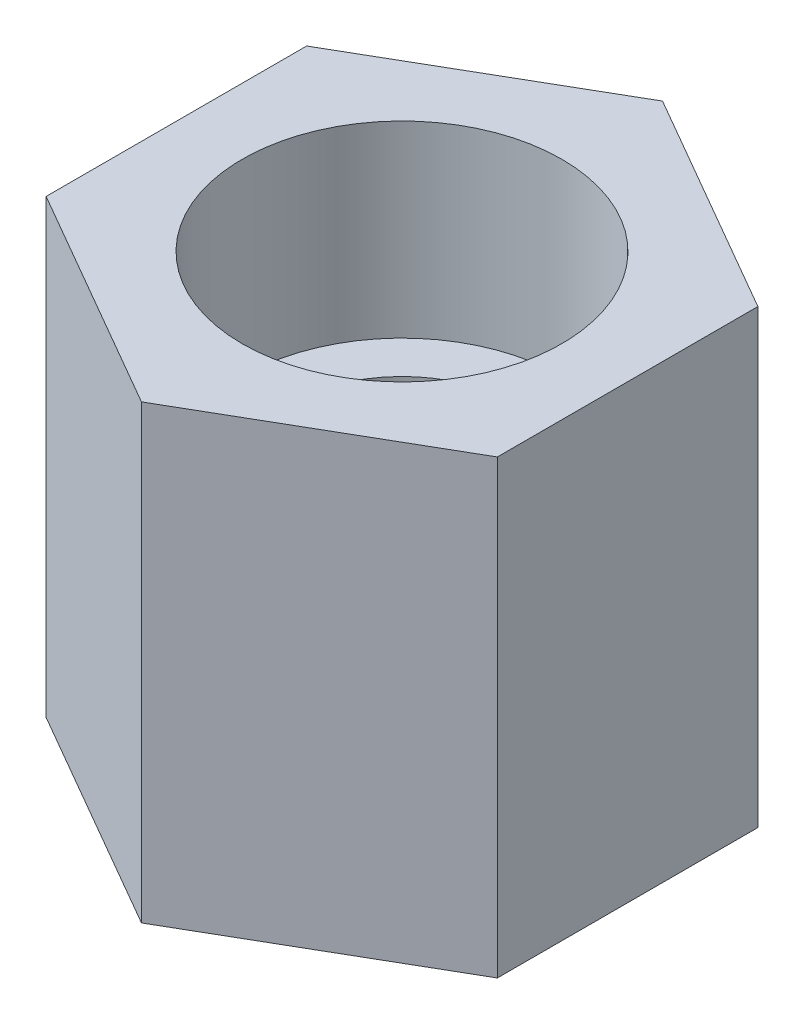
ISO-10303-21;
HEADER;
FILE_DESCRIPTION(('STEP AP214'),'2;1');
FILE_NAME('part.step','',(''),(''),'','','');
FILE_SCHEMA(('AUTOMOTIVE_DESIGN { 1 0 10303 214 1 1 1 1 }'));
ENDSEC;
DATA;
#1=APPLICATION_CONTEXT('core data for automotive mechanical design processes');
#2=APPLICATION_PROTOCOL_DEFINITION('international standard','automotive_design',2000,#1);
#3=PRODUCT_CONTEXT('',#1,'mechanical');
#4=PRODUCT('Part','Part','',(#3));
#5=PRODUCT_RELATED_PRODUCT_CATEGORY('part','',(#4));
#6=PRODUCT_DEFINITION_FORMATION('','',#4);
#7=PRODUCT_DEFINITION_CONTEXT('part definition',#1,'design');
#8=PRODUCT_DEFINITION('design','',#6,#7);
#9=PRODUCT_DEFINITION_SHAPE('','',#8);
#10=(LENGTH_UNIT() NAMED_UNIT(*) SI_UNIT(.MILLI.,.METRE.));
#11=(NAMED_UNIT(*) PLANE_ANGLE_UNIT() SI_UNIT($,.RADIAN.));
#12=(NAMED_UNIT(*) SI_UNIT($,.STERADIAN.) SOLID_ANGLE_UNIT());
#13=UNCERTAINTY_MEASURE_WITH_UNIT(LENGTH_MEASURE(1.E-05),#10,'distance_accuracy_value','');
#14=(GEOMETRIC_REPRESENTATION_CONTEXT(3) GLOBAL_UNCERTAINTY_ASSIGNED_CONTEXT((#13)) GLOBAL_UNIT_ASSIGNED_CONTEXT((#10,
#11,#12)) REPRESENTATION_CONTEXT('',''));
#15=CARTESIAN_POINT('',(0.,0.,0.));
#16=DIRECTION('',(0.,0.,1.));
#17=DIRECTION('',(1.,0.,0.));
#18=AXIS2_PLACEMENT_3D('',#15,#16,#17);
#19=CARTESIAN_POINT('',(0.,24.,0.));
#20=DIRECTION('',(0.,-1.,0.));
#21=DIRECTION('',(0.,0.,-1.));
#22=AXIS2_PLACEMENT_3D('',#19,#20,#21);
#23=CYLINDRICAL_SURFACE('',#22,6.);
#24=CARTESIAN_POINT('',(0.,0.,0.));
#25=DIRECTION('',(0.,1.,0.));
#26=DIRECTION('',(0.,0.,1.));
#27=AXIS2_PLACEMENT_3D('',#24,#25,#26);
#28=CIRCLE('',#27,6.);
#29=CARTESIAN_POINT('',(0.,0.,6.));
#30=VERTEX_POINT('',#29);
#31=EDGE_CURVE('E124',#30,#30,#28,.T.);
#32=ORIENTED_EDGE('',*,*,#31,.F.);
#33=EDGE_LOOP('',(#32));
#34=FACE_BOUND('',#33,.T.);
#35=CARTESIAN_POINT('',(0.,14.,0.));
#36=DIRECTION('',(0.,1.,0.));
#37=DIRECTION('',(0.,0.,1.));
#38=AXIS2_PLACEMENT_3D('',#35,#36,#37);
#39=CIRCLE('',#38,6.);
#40=CARTESIAN_POINT('',(0.,14.,6.));
#41=VERTEX_POINT('',#40);
#42=EDGE_CURVE('E38',#41,#41,#39,.T.);
#43=ORIENTED_EDGE('',*,*,#42,.T.);
#44=EDGE_LOOP('',(#43));
#45=FACE_BOUND('',#44,.T.);
#46=ADVANCED_FACE('F34',(#34,#45),#23,.F.);
#47=CARTESIAN_POINT('',(0.,24.,0.));
#48=DIRECTION('',(0.,1.,0.));
#49=DIRECTION('',(0.,0.,1.));
#50=AXIS2_PLACEMENT_3D('',#47,#48,#49);
#51=PLANE('',#50);
#52=CARTESIAN_POINT('',(0.,24.,0.));
#53=DIRECTION('',(0.,1.,0.));
#54=DIRECTION('',(0.,0.,1.));
#55=AXIS2_PLACEMENT_3D('',#52,#53,#54);
#56=CIRCLE('',#55,8.5);
#57=CARTESIAN_POINT('',(0.,24.,8.5));
#58=VERTEX_POINT('',#57);
#59=EDGE_CURVE('E231',#58,#58,#56,.T.);
#60=ORIENTED_EDGE('',*,*,#59,.F.);
#61=EDGE_LOOP('',(#60));
#62=FACE_BOUND('',#61,.T.);
#63=DIRECTION('',(-0.866025403784439,0.,-0.5));
#64=VECTOR('',#63,1.);
#65=CARTESIAN_POINT('',(12.,24.,-6.92820323027552));
#66=LINE('',#65,#64);
#67=CARTESIAN_POINT('',(12.,24.,-6.92820323027552));
#68=VERTEX_POINT('',#67);
#69=CARTESIAN_POINT('',(0.,24.,-13.856406460551));
#70=VERTEX_POINT('',#69);
#71=EDGE_CURVE('E131',#68,#70,#66,.T.);
#72=ORIENTED_EDGE('',*,*,#71,.T.);
#73=DIRECTION('',(-0.866025403784439,0.,0.5));
#74=VECTOR('',#73,1.);
#75=CARTESIAN_POINT('',(0.,24.,-13.856406460551));
#76=LINE('',#75,#74);
#77=CARTESIAN_POINT('',(-12.,24.,-6.92820323027551));
#78=VERTEX_POINT('',#77);
#79=EDGE_CURVE('E89',#70,#78,#76,.T.);
#80=ORIENTED_EDGE('',*,*,#79,.T.);
#81=DIRECTION('',(0.,0.,1.));
#82=VECTOR('',#81,1.);
#83=CARTESIAN_POINT('',(-12.,24.,-6.92820323027551));
#84=LINE('',#83,#82);
#85=CARTESIAN_POINT('',(-12.,24.,6.92820323027551));
#86=VERTEX_POINT('',#85);
#87=EDGE_CURVE('E102',#78,#86,#84,.T.);
#88=ORIENTED_EDGE('',*,*,#87,.T.);
#89=DIRECTION('',(0.866025403784439,0.,0.5));
#90=VECTOR('',#89,1.);
#91=CARTESIAN_POINT('',(-12.,24.,6.92820323027551));
#92=LINE('',#91,#90);
#93=CARTESIAN_POINT('',(0.,24.,13.856406460551));
#94=VERTEX_POINT('',#93);
#95=EDGE_CURVE('E96',#86,#94,#92,.T.);
#96=ORIENTED_EDGE('',*,*,#95,.T.);
#97=DIRECTION('',(0.866025403784439,0.,-0.5));
#98=VECTOR('',#97,1.);
#99=CARTESIAN_POINT('',(0.,24.,13.856406460551));
#100=LINE('',#99,#98);
#101=CARTESIAN_POINT('',(12.,24.,6.92820323027551));
#102=VERTEX_POINT('',#101);
#103=EDGE_CURVE('E100',#94,#102,#100,.T.);
#104=ORIENTED_EDGE('',*,*,#103,.T.);
#105=DIRECTION('',(0.,0.,-1.));
#106=VECTOR('',#105,1.);
#107=CARTESIAN_POINT('',(12.,24.,6.92820323027551));
#108=LINE('',#107,#106);
#109=EDGE_CURVE('E52',#102,#68,#108,.T.);
#110=ORIENTED_EDGE('',*,*,#109,.T.);
#111=EDGE_LOOP('',(#72,#80,#88,#96,#104,#110));
#112=FACE_BOUND('',#111,.T.);
#113=ADVANCED_FACE('F98',(#62,#112),#51,.T.);
#114=CARTESIAN_POINT('',(0.,0.,0.));
#115=DIRECTION('',(0.,1.,0.));
#116=DIRECTION('',(0.,0.,1.));
#117=AXIS2_PLACEMENT_3D('',#114,#115,#116);
#118=PLANE('',#117);
#119=DIRECTION('',(-0.866025403784439,0.,-0.5));
#120=VECTOR('',#119,1.);
#121=CARTESIAN_POINT('',(12.,0.,-6.92820323027552));
#122=LINE('',#121,#120);
#123=CARTESIAN_POINT('',(12.,0.,-6.92820323027552));
#124=VERTEX_POINT('',#123);
#125=CARTESIAN_POINT('',(0.,0.,-13.856406460551));
#126=VERTEX_POINT('',#125);
#127=EDGE_CURVE('E120',#124,#126,#122,.T.);
#128=ORIENTED_EDGE('',*,*,#127,.F.);
#129=DIRECTION('',(0.,0.,-1.));
#130=VECTOR('',#129,1.);
#131=CARTESIAN_POINT('',(12.,0.,6.92820323027551));
#132=LINE('',#131,#130);
#133=CARTESIAN_POINT('',(12.,0.,6.92820323027551));
#134=VERTEX_POINT('',#133);
#135=EDGE_CURVE('E81',#134,#124,#132,.T.);
#136=ORIENTED_EDGE('',*,*,#135,.F.);
#137=DIRECTION('',(0.866025403784439,0.,-0.5));
#138=VECTOR('',#137,1.);
#139=CARTESIAN_POINT('',(0.,0.,13.856406460551));
#140=LINE('',#139,#138);
#141=CARTESIAN_POINT('',(0.,0.,13.856406460551));
#142=VERTEX_POINT('',#141);
#143=EDGE_CURVE('E75',#142,#134,#140,.T.);
#144=ORIENTED_EDGE('',*,*,#143,.F.);
#145=DIRECTION('',(0.866025403784439,0.,0.5));
#146=VECTOR('',#145,1.);
#147=CARTESIAN_POINT('',(-12.,0.,6.92820323027551));
#148=LINE('',#147,#146);
#149=CARTESIAN_POINT('',(-12.,0.,6.92820323027551));
#150=VERTEX_POINT('',#149);
#151=EDGE_CURVE('E110',#150,#142,#148,.T.);
#152=ORIENTED_EDGE('',*,*,#151,.F.);
#153=DIRECTION('',(0.,0.,1.));
#154=VECTOR('',#153,1.);
#155=CARTESIAN_POINT('',(-12.,0.,-6.92820323027551));
#156=LINE('',#155,#154);
#157=CARTESIAN_POINT('',(-12.,0.,-6.92820323027551));
#158=VERTEX_POINT('',#157);
#159=EDGE_CURVE('E126',#158,#150,#156,.T.);
#160=ORIENTED_EDGE('',*,*,#159,.F.);
#161=DIRECTION('',(-0.866025403784439,0.,0.5));
#162=VECTOR('',#161,1.);
#163=CARTESIAN_POINT('',(0.,0.,-13.856406460551));
#164=LINE('',#163,#162);
#165=EDGE_CURVE('E123',#126,#158,#164,.T.);
#166=ORIENTED_EDGE('',*,*,#165,.F.);
#167=EDGE_LOOP('',(#128,#136,#144,#152,#160,#166));
#168=FACE_BOUND('',#167,.T.);
#169=ORIENTED_EDGE('',*,*,#31,.T.);
#170=EDGE_LOOP('',(#169));
#171=FACE_BOUND('',#170,.T.);
#172=ADVANCED_FACE('F141',(#168,#171),#118,.F.);
#173=CARTESIAN_POINT('',(12.,24.,-6.92820323027552));
#174=DIRECTION('',(-0.5,0.,0.866025403784439));
#175=DIRECTION('',(0.866025403784439,0.,0.5));
#176=AXIS2_PLACEMENT_3D('',#173,#174,#175);
#177=PLANE('',#176);
#178=ORIENTED_EDGE('',*,*,#127,.T.);
#179=DIRECTION('',(0.,-1.,0.));
#180=VECTOR('',#179,1.);
#181=CARTESIAN_POINT('',(0.,24.,-13.856406460551));
#182=LINE('',#181,#180);
#183=EDGE_CURVE('E11',#70,#126,#182,.T.);
#184=ORIENTED_EDGE('',*,*,#183,.F.);
#185=ORIENTED_EDGE('',*,*,#71,.F.);
#186=DIRECTION('',(0.,-1.,0.));
#187=VECTOR('',#186,1.);
#188=CARTESIAN_POINT('',(12.,24.,-6.92820323027552));
#189=LINE('',#188,#187);
#190=EDGE_CURVE('E116',#68,#124,#189,.T.);
#191=ORIENTED_EDGE('',*,*,#190,.T.);
#192=EDGE_LOOP('',(#178,#184,#185,#191));
#193=FACE_BOUND('',#192,.T.);
#194=ADVANCED_FACE('F36',(#193),#177,.F.);
#195=CARTESIAN_POINT('',(0.,24.,-13.856406460551));
#196=DIRECTION('',(0.5,0.,0.866025403784438));
#197=DIRECTION('',(0.866025403784439,0.,-0.5));
#198=AXIS2_PLACEMENT_3D('',#195,#196,#197);
#199=PLANE('',#198);
#200=ORIENTED_EDGE('',*,*,#165,.T.);
#201=DIRECTION('',(0.,-1.,0.));
#202=VECTOR('',#201,1.);
#203=CARTESIAN_POINT('',(-12.,24.,-6.92820323027551));
#204=LINE('',#203,#202);
#205=EDGE_CURVE('E44',#78,#158,#204,.T.);
#206=ORIENTED_EDGE('',*,*,#205,.F.);
#207=ORIENTED_EDGE('',*,*,#79,.F.);
#208=ORIENTED_EDGE('',*,*,#183,.T.);
#209=EDGE_LOOP('',(#200,#206,#207,#208));
#210=FACE_BOUND('',#209,.T.);
#211=ADVANCED_FACE('F174',(#210),#199,.F.);
#212=CARTESIAN_POINT('',(-12.,24.,-6.92820323027551));
#213=DIRECTION('',(1.,0.,0.));
#214=DIRECTION('',(0.,0.,-1.));
#215=AXIS2_PLACEMENT_3D('',#212,#213,#214);
#216=PLANE('',#215);
#217=ORIENTED_EDGE('',*,*,#159,.T.);
#218=DIRECTION('',(0.,-1.,0.));
#219=VECTOR('',#218,1.);
#220=CARTESIAN_POINT('',(-12.,24.,6.92820323027551));
#221=LINE('',#220,#219);
#222=EDGE_CURVE('E111',#86,#150,#221,.T.);
#223=ORIENTED_EDGE('',*,*,#222,.F.);
#224=ORIENTED_EDGE('',*,*,#87,.F.);
#225=ORIENTED_EDGE('',*,*,#205,.T.);
#226=EDGE_LOOP('',(#217,#223,#224,#225));
#227=FACE_BOUND('',#226,.T.);
#228=ADVANCED_FACE('F138',(#227),#216,.F.);
#229=CARTESIAN_POINT('',(-12.,24.,6.92820323027551));
#230=DIRECTION('',(0.5,0.,-0.866025403784439));
#231=DIRECTION('',(-0.866025403784439,0.,-0.5));
#232=AXIS2_PLACEMENT_3D('',#229,#230,#231);
#233=PLANE('',#232);
#234=ORIENTED_EDGE('',*,*,#151,.T.);
#235=DIRECTION('',(0.,-1.,0.));
#236=VECTOR('',#235,1.);
#237=CARTESIAN_POINT('',(0.,24.,13.856406460551));
#238=LINE('',#237,#236);
#239=EDGE_CURVE('E107',#94,#142,#238,.T.);
#240=ORIENTED_EDGE('',*,*,#239,.F.);
#241=ORIENTED_EDGE('',*,*,#95,.F.);
#242=ORIENTED_EDGE('',*,*,#222,.T.);
#243=EDGE_LOOP('',(#234,#240,#241,#242));
#244=FACE_BOUND('',#243,.T.);
#245=ADVANCED_FACE('F108',(#244),#233,.F.);
#246=CARTESIAN_POINT('',(0.,24.,13.856406460551));
#247=DIRECTION('',(-0.5,0.,-0.866025403784439));
#248=DIRECTION('',(-0.866025403784439,0.,0.5));
#249=AXIS2_PLACEMENT_3D('',#246,#247,#248);
#250=PLANE('',#249);
#251=ORIENTED_EDGE('',*,*,#143,.T.);
#252=DIRECTION('',(0.,-1.,0.));
#253=VECTOR('',#252,1.);
#254=CARTESIAN_POINT('',(12.,24.,6.92820323027551));
#255=LINE('',#254,#253);
#256=EDGE_CURVE('E112',#102,#134,#255,.T.);
#257=ORIENTED_EDGE('',*,*,#256,.F.);
#258=ORIENTED_EDGE('',*,*,#103,.F.);
#259=ORIENTED_EDGE('',*,*,#239,.T.);
#260=EDGE_LOOP('',(#251,#257,#258,#259));
#261=FACE_BOUND('',#260,.T.);
#262=ADVANCED_FACE('F114',(#261),#250,.F.);
#263=CARTESIAN_POINT('',(12.,24.,6.92820323027551));
#264=DIRECTION('',(-1.,0.,0.));
#265=DIRECTION('',(0.,0.,1.));
#266=AXIS2_PLACEMENT_3D('',#263,#264,#265);
#267=PLANE('',#266);
#268=ORIENTED_EDGE('',*,*,#135,.T.);
#269=ORIENTED_EDGE('',*,*,#190,.F.);
#270=ORIENTED_EDGE('',*,*,#109,.F.);
#271=ORIENTED_EDGE('',*,*,#256,.T.);
#272=EDGE_LOOP('',(#268,#269,#270,#271));
#273=FACE_BOUND('',#272,.T.);
#274=ADVANCED_FACE('F146',(#273),#267,.F.);
#275=CARTESIAN_POINT('',(0.,14.,0.));
#276=DIRECTION('',(0.,1.,0.));
#277=DIRECTION('',(0.,0.,1.));
#278=AXIS2_PLACEMENT_3D('',#275,#276,#277);
#279=CYLINDRICAL_SURFACE('',#278,8.5);
#280=CARTESIAN_POINT('',(0.,14.,0.));
#281=DIRECTION('',(0.,1.,0.));
#282=DIRECTION('',(0.,0.,1.));
#283=AXIS2_PLACEMENT_3D('',#280,#281,#282);
#284=CIRCLE('',#283,8.5);
#285=CARTESIAN_POINT('',(0.,14.,8.5));
#286=VERTEX_POINT('',#285);
#287=EDGE_CURVE('E230',#286,#286,#284,.T.);
#288=ORIENTED_EDGE('',*,*,#287,.F.);
#289=EDGE_LOOP('',(#288));
#290=FACE_BOUND('',#289,.T.);
#291=ORIENTED_EDGE('',*,*,#59,.T.);
#292=EDGE_LOOP('',(#291));
#293=FACE_BOUND('',#292,.T.);
#294=ADVANCED_FACE('F148',(#290,#293),#279,.F.);
#295=CARTESIAN_POINT('',(0.,14.,0.));
#296=DIRECTION('',(0.,1.,0.));
#297=DIRECTION('',(0.,0.,1.));
#298=AXIS2_PLACEMENT_3D('',#295,#296,#297);
#299=PLANE('',#298);
#300=ORIENTED_EDGE('',*,*,#42,.F.);
#301=EDGE_LOOP('',(#300));
#302=FACE_BOUND('',#301,.T.);
#303=ORIENTED_EDGE('',*,*,#287,.T.);
#304=EDGE_LOOP('',(#303));
#305=FACE_BOUND('',#304,.T.);
#306=ADVANCED_FACE('F154',(#302,#305),#299,.T.);
#307=CLOSED_SHELL('',(#46,#113,#172,#194,#211,#228,#245,#262,#274,#294,#306));
#308=MANIFOLD_SOLID_BREP('B2',#307);
#309=ADVANCED_BREP_SHAPE_REPRESENTATION('',(#18,#308),#14);
#310=SHAPE_DEFINITION_REPRESENTATION(#9,#309);
ENDSEC;
END-ISO-10303-21;
